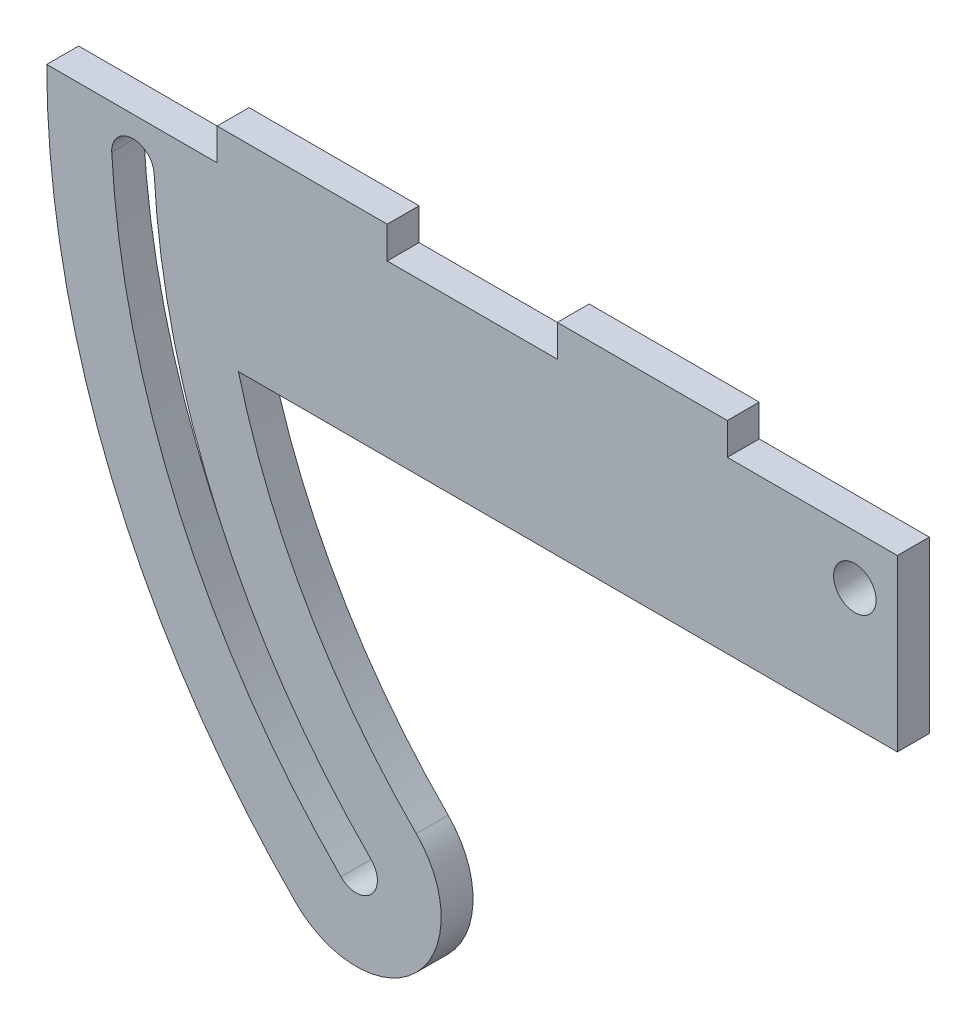
ISO-10303-21;
HEADER;
FILE_DESCRIPTION(('STEP AP214'),'2;1');
FILE_NAME('part.step','',(''),(''),'','','');
FILE_SCHEMA(('AUTOMOTIVE_DESIGN { 1 0 10303 214 1 1 1 1 }'));
ENDSEC;
DATA;
#1=APPLICATION_CONTEXT('core data for automotive mechanical design processes');
#2=APPLICATION_PROTOCOL_DEFINITION('international standard','automotive_design',2000,#1);
#3=PRODUCT_CONTEXT('',#1,'mechanical');
#4=PRODUCT('Part','Part','',(#3));
#5=PRODUCT_RELATED_PRODUCT_CATEGORY('part','',(#4));
#6=PRODUCT_DEFINITION_FORMATION('','',#4);
#7=PRODUCT_DEFINITION_CONTEXT('part definition',#1,'design');
#8=PRODUCT_DEFINITION('design','',#6,#7);
#9=PRODUCT_DEFINITION_SHAPE('','',#8);
#10=(LENGTH_UNIT() NAMED_UNIT(*) SI_UNIT(.MILLI.,.METRE.));
#11=(NAMED_UNIT(*) PLANE_ANGLE_UNIT() SI_UNIT($,.RADIAN.));
#12=(NAMED_UNIT(*) SI_UNIT($,.STERADIAN.) SOLID_ANGLE_UNIT());
#13=UNCERTAINTY_MEASURE_WITH_UNIT(LENGTH_MEASURE(1.E-05),#10,'distance_accuracy_value','');
#14=(GEOMETRIC_REPRESENTATION_CONTEXT(3) GLOBAL_UNCERTAINTY_ASSIGNED_CONTEXT((#13)) GLOBAL_UNIT_ASSIGNED_CONTEXT((#10,
#11,#12)) REPRESENTATION_CONTEXT('',''));
#15=CARTESIAN_POINT('',(0.,0.,0.));
#16=DIRECTION('',(0.,0.,1.));
#17=DIRECTION('',(1.,0.,0.));
#18=AXIS2_PLACEMENT_3D('',#15,#16,#17);
#19=CARTESIAN_POINT('',(127.,26.4331621621626,4.7625));
#20=DIRECTION('',(0.,0.,1.));
#21=DIRECTION('',(1.,0.,0.));
#22=AXIS2_PLACEMENT_3D('',#19,#20,#21);
#23=PLANE('',#22);
#24=CARTESIAN_POINT('',(127.,26.4331621621626,4.7625));
#25=DIRECTION('',(0.,0.,-1.));
#26=DIRECTION('',(1.,0.,0.));
#27=AXIS2_PLACEMENT_3D('',#24,#25,#26);
#28=CIRCLE('',#27,111.177818334353);
#29=CARTESIAN_POINT('',(48.3854107382526,-52.1814270995844,4.7625));
#30=VERTEX_POINT('',#29);
#31=CARTESIAN_POINT('',(15.9951351351355,20.2341891891896,4.7625));
#32=VERTEX_POINT('',#31);
#33=EDGE_CURVE('E166',#30,#32,#28,.T.);
#34=ORIENTED_EDGE('',*,*,#33,.F.);
#35=CARTESIAN_POINT('',(46.1607079705548,-54.4466693814164,4.7625));
#36=DIRECTION('',(0.,0.,1.));
#37=DIRECTION('',(-1.,0.,0.));
#38=AXIS2_PLACEMENT_3D('',#35,#36,#37);
#39=CIRCLE('',#38,3.17500000000025);
#40=CARTESIAN_POINT('',(43.8954656887227,-56.6713721491141,4.7625));
#41=VERTEX_POINT('',#40);
#42=EDGE_CURVE('E158',#41,#30,#39,.T.);
#43=ORIENTED_EDGE('',*,*,#42,.F.);
#44=CARTESIAN_POINT('',(127.,26.4331621621626,4.7625));
#45=DIRECTION('',(0.,0.,1.));
#46=DIRECTION('',(1.,0.,0.));
#47=AXIS2_PLACEMENT_3D('',#44,#45,#46);
#48=CIRCLE('',#47,117.527559517708);
#49=CARTESIAN_POINT('',(9.65200000000002,19.939,4.7625));
#50=VERTEX_POINT('',#49);
#51=EDGE_CURVE('E181',#50,#41,#48,.T.);
#52=ORIENTED_EDGE('',*,*,#51,.F.);
#53=CARTESIAN_POINT('',(12.8235675675678,20.0865945945948,4.7625));
#54=DIRECTION('',(0.,0.,1.));
#55=DIRECTION('',(1.,0.,0.));
#56=AXIS2_PLACEMENT_3D('',#53,#54,#55);
#57=CIRCLE('',#56,3.17500000000021);
#58=EDGE_CURVE('E179',#32,#50,#57,.T.);
#59=ORIENTED_EDGE('',*,*,#58,.F.);
#60=EDGE_LOOP('',(#34,#43,#52,#59));
#61=FACE_BOUND('',#60,.T.);
#62=CARTESIAN_POINT('',(127.,26.4331621621626,4.7625));
#63=DIRECTION('',(0.,0.,-1.));
#64=DIRECTION('',(1.,0.,0.));
#65=AXIS2_PLACEMENT_3D('',#62,#63,#64);
#66=CIRCLE('',#65,101.652692967862);
#67=CARTESIAN_POINT('',(55.140964091624,-45.4664132603473,4.7625));
#68=VERTEX_POINT('',#67);
#69=CARTESIAN_POINT('',(28.5752032595833,1.01998892019713,4.7625));
#70=VERTEX_POINT('',#69);
#71=EDGE_CURVE('E197',#68,#70,#66,.T.);
#72=ORIENTED_EDGE('',*,*,#71,.T.);
#73=DIRECTION('',(1.,0.,0.));
#74=VECTOR('',#73,1.);
#75=CARTESIAN_POINT('',(28.5752032595833,1.01998892019713,4.7625));
#76=LINE('',#75,#74);
#77=CARTESIAN_POINT('',(127.,1.01998892019713,4.7625));
#78=VERTEX_POINT('',#77);
#79=EDGE_CURVE('E200',#70,#78,#76,.T.);
#80=ORIENTED_EDGE('',*,*,#79,.T.);
#81=DIRECTION('',(0.,1.,0.));
#82=VECTOR('',#81,1.);
#83=CARTESIAN_POINT('',(127.,1.01998892019713,4.7625));
#84=LINE('',#83,#82);
#85=CARTESIAN_POINT('',(127.,26.4331621621626,4.7625));
#86=VERTEX_POINT('',#85);
#87=EDGE_CURVE('E203',#78,#86,#84,.T.);
#88=ORIENTED_EDGE('',*,*,#87,.T.);
#89=DIRECTION('',(-1.,0.,0.));
#90=VECTOR('',#89,1.);
#91=CARTESIAN_POINT('',(101.6,26.4331621621626,4.7625));
#92=LINE('',#91,#90);
#93=CARTESIAN_POINT('',(101.6,26.4331621621626,4.7625));
#94=VERTEX_POINT('',#93);
#95=EDGE_CURVE('E205',#86,#94,#92,.T.);
#96=ORIENTED_EDGE('',*,*,#95,.T.);
#97=DIRECTION('',(0.,1.,0.));
#98=VECTOR('',#97,1.);
#99=CARTESIAN_POINT('',(101.6,26.4331621621626,4.7625));
#100=LINE('',#99,#98);
#101=CARTESIAN_POINT('',(101.6,31.1956621621626,4.7625));
#102=VERTEX_POINT('',#101);
#103=EDGE_CURVE('E207',#94,#102,#100,.T.);
#104=ORIENTED_EDGE('',*,*,#103,.T.);
#105=DIRECTION('',(-1.,0.,0.));
#106=VECTOR('',#105,1.);
#107=CARTESIAN_POINT('',(101.6,31.1956621621626,4.7625));
#108=LINE('',#107,#106);
#109=CARTESIAN_POINT('',(76.2000000000004,31.1956621621626,4.7625));
#110=VERTEX_POINT('',#109);
#111=EDGE_CURVE('E209',#102,#110,#108,.T.);
#112=ORIENTED_EDGE('',*,*,#111,.T.);
#113=DIRECTION('',(0.,-1.,0.));
#114=VECTOR('',#113,1.);
#115=CARTESIAN_POINT('',(76.2000000000004,26.4331621621626,4.7625));
#116=LINE('',#115,#114);
#117=CARTESIAN_POINT('',(76.2000000000004,26.4331621621626,4.7625));
#118=VERTEX_POINT('',#117);
#119=EDGE_CURVE('E211',#110,#118,#116,.T.);
#120=ORIENTED_EDGE('',*,*,#119,.T.);
#121=DIRECTION('',(-1.,0.,0.));
#122=VECTOR('',#121,1.);
#123=CARTESIAN_POINT('',(50.7999999999996,26.4331621621626,4.7625));
#124=LINE('',#123,#122);
#125=CARTESIAN_POINT('',(50.7999999999996,26.4331621621626,4.7625));
#126=VERTEX_POINT('',#125);
#127=EDGE_CURVE('E213',#118,#126,#124,.T.);
#128=ORIENTED_EDGE('',*,*,#127,.T.);
#129=DIRECTION('',(0.,1.,0.));
#130=VECTOR('',#129,1.);
#131=CARTESIAN_POINT('',(50.7999999999996,26.4331621621626,4.7625));
#132=LINE('',#131,#130);
#133=CARTESIAN_POINT('',(50.7999999999996,31.1956621621626,4.7625));
#134=VERTEX_POINT('',#133);
#135=EDGE_CURVE('E215',#126,#134,#132,.T.);
#136=ORIENTED_EDGE('',*,*,#135,.T.);
#137=DIRECTION('',(-1.,0.,0.));
#138=VECTOR('',#137,1.);
#139=CARTESIAN_POINT('',(25.3999999999996,31.1956621621626,4.7625));
#140=LINE('',#139,#138);
#141=CARTESIAN_POINT('',(25.3999999999996,31.1956621621626,4.7625));
#142=VERTEX_POINT('',#141);
#143=EDGE_CURVE('E217',#134,#142,#140,.T.);
#144=ORIENTED_EDGE('',*,*,#143,.T.);
#145=DIRECTION('',(0.,-1.,0.));
#146=VECTOR('',#145,1.);
#147=CARTESIAN_POINT('',(25.3999999999996,26.4331621621626,4.7625));
#148=LINE('',#147,#146);
#149=CARTESIAN_POINT('',(25.3999999999996,26.4331621621626,4.7625));
#150=VERTEX_POINT('',#149);
#151=EDGE_CURVE('E219',#142,#150,#148,.T.);
#152=ORIENTED_EDGE('',*,*,#151,.T.);
#153=DIRECTION('',(-1.,0.,0.));
#154=VECTOR('',#153,1.);
#155=CARTESIAN_POINT('',(-0.0526921598312802,26.4331621621626,4.7625));
#156=LINE('',#155,#154);
#157=CARTESIAN_POINT('',(-0.0526921598312802,26.4331621621626,4.7625));
#158=VERTEX_POINT('',#157);
#159=EDGE_CURVE('E221',#150,#158,#156,.T.);
#160=ORIENTED_EDGE('',*,*,#159,.T.);
#161=CARTESIAN_POINT('',(127.,26.4331621621626,4.7625));
#162=DIRECTION('',(0.,0.,1.));
#163=DIRECTION('',(1.,0.,0.));
#164=AXIS2_PLACEMENT_3D('',#161,#162,#163);
#165=CIRCLE('',#164,127.052692159831);
#166=CARTESIAN_POINT('',(37.1804518494856,-63.4269255024856,4.7625));
#167=VERTEX_POINT('',#166);
#168=EDGE_CURVE('E223',#158,#167,#165,.T.);
#169=ORIENTED_EDGE('',*,*,#168,.T.);
#170=CARTESIAN_POINT('',(46.1607079705548,-54.4466693814164,4.7625));
#171=DIRECTION('',(0.,0.,1.));
#172=DIRECTION('',(-1.,0.,0.));
#173=AXIS2_PLACEMENT_3D('',#170,#171,#172);
#174=CIRCLE('',#173,12.7);
#175=EDGE_CURVE('E225',#167,#68,#174,.T.);
#176=ORIENTED_EDGE('',*,*,#175,.T.);
#177=EDGE_LOOP('',(#72,#80,#88,#96,#104,#112,#120,#128,#136,#144,#152,#160,#169,#176));
#178=FACE_BOUND('',#177,.T.);
#179=CARTESIAN_POINT('',(120.65,19.05,4.7625));
#180=DIRECTION('',(0.,0.,1.));
#181=DIRECTION('',(1.,0.,0.));
#182=AXIS2_PLACEMENT_3D('',#179,#180,#181);
#183=CIRCLE('',#182,3.175);
#184=CARTESIAN_POINT('',(123.825,19.05,4.7625));
#185=VERTEX_POINT('',#184);
#186=EDGE_CURVE('E187',#185,#185,#183,.T.);
#187=ORIENTED_EDGE('',*,*,#186,.F.);
#188=EDGE_LOOP('',(#187));
#189=FACE_BOUND('',#188,.T.);
#190=ADVANCED_FACE('F33',(#61,#178,#189),#23,.T.);
#191=CARTESIAN_POINT('',(127.,26.4331621621626,0.));
#192=DIRECTION('',(0.,0.,1.));
#193=DIRECTION('',(1.,0.,0.));
#194=AXIS2_PLACEMENT_3D('',#191,#192,#193);
#195=PLANE('',#194);
#196=CARTESIAN_POINT('',(46.1607079705548,-54.4466693814164,0.));
#197=DIRECTION('',(0.,0.,1.));
#198=DIRECTION('',(-1.,0.,0.));
#199=AXIS2_PLACEMENT_3D('',#196,#197,#198);
#200=CIRCLE('',#199,3.17500000000025);
#201=CARTESIAN_POINT('',(43.8954656887227,-56.6713721491141,0.));
#202=VERTEX_POINT('',#201);
#203=CARTESIAN_POINT('',(48.3854107382526,-52.1814270995844,0.));
#204=VERTEX_POINT('',#203);
#205=EDGE_CURVE('E56',#202,#204,#200,.T.);
#206=ORIENTED_EDGE('',*,*,#205,.T.);
#207=CARTESIAN_POINT('',(127.,26.4331621621626,0.));
#208=DIRECTION('',(0.,0.,-1.));
#209=DIRECTION('',(1.,0.,0.));
#210=AXIS2_PLACEMENT_3D('',#207,#208,#209);
#211=CIRCLE('',#210,111.177818334353);
#212=CARTESIAN_POINT('',(15.9951351351355,20.2341891891896,0.));
#213=VERTEX_POINT('',#212);
#214=EDGE_CURVE('E173',#204,#213,#211,.T.);
#215=ORIENTED_EDGE('',*,*,#214,.T.);
#216=CARTESIAN_POINT('',(12.8235675675678,20.0865945945948,0.));
#217=DIRECTION('',(0.,0.,1.));
#218=DIRECTION('',(1.,0.,0.));
#219=AXIS2_PLACEMENT_3D('',#216,#217,#218);
#220=CIRCLE('',#219,3.17500000000021);
#221=CARTESIAN_POINT('',(9.652,19.939,0.));
#222=VERTEX_POINT('',#221);
#223=EDGE_CURVE('E189',#213,#222,#220,.T.);
#224=ORIENTED_EDGE('',*,*,#223,.T.);
#225=CARTESIAN_POINT('',(127.,26.4331621621626,0.));
#226=DIRECTION('',(0.,0.,1.));
#227=DIRECTION('',(1.,0.,0.));
#228=AXIS2_PLACEMENT_3D('',#225,#226,#227);
#229=CIRCLE('',#228,117.527559517708);
#230=EDGE_CURVE('E167',#222,#202,#229,.T.);
#231=ORIENTED_EDGE('',*,*,#230,.T.);
#232=EDGE_LOOP('',(#206,#215,#224,#231));
#233=FACE_BOUND('',#232,.T.);
#234=CARTESIAN_POINT('',(127.,26.4331621621626,0.));
#235=DIRECTION('',(0.,0.,-1.));
#236=DIRECTION('',(1.,0.,0.));
#237=AXIS2_PLACEMENT_3D('',#234,#235,#236);
#238=CIRCLE('',#237,101.652692967862);
#239=CARTESIAN_POINT('',(55.140964091624,-45.4664132603473,0.));
#240=VERTEX_POINT('',#239);
#241=CARTESIAN_POINT('',(28.5752032595833,1.01998892019713,0.));
#242=VERTEX_POINT('',#241);
#243=EDGE_CURVE('E174',#240,#242,#238,.T.);
#244=ORIENTED_EDGE('',*,*,#243,.F.);
#245=CARTESIAN_POINT('',(46.1607079705548,-54.4466693814164,0.));
#246=DIRECTION('',(0.,0.,1.));
#247=DIRECTION('',(-1.,0.,0.));
#248=AXIS2_PLACEMENT_3D('',#245,#246,#247);
#249=CIRCLE('',#248,12.7);
#250=CARTESIAN_POINT('',(37.1804518494856,-63.4269255024856,0.));
#251=VERTEX_POINT('',#250);
#252=EDGE_CURVE('E201',#251,#240,#249,.T.);
#253=ORIENTED_EDGE('',*,*,#252,.F.);
#254=CARTESIAN_POINT('',(127.,26.4331621621626,0.));
#255=DIRECTION('',(0.,0.,1.));
#256=DIRECTION('',(1.,0.,0.));
#257=AXIS2_PLACEMENT_3D('',#254,#255,#256);
#258=CIRCLE('',#257,127.052692159831);
#259=CARTESIAN_POINT('',(-0.0526921598312802,26.4331621621626,0.));
#260=VERTEX_POINT('',#259);
#261=EDGE_CURVE('E252',#260,#251,#258,.T.);
#262=ORIENTED_EDGE('',*,*,#261,.F.);
#263=DIRECTION('',(-1.,0.,0.));
#264=VECTOR('',#263,1.);
#265=CARTESIAN_POINT('',(-0.0526921598312802,26.4331621621626,0.));
#266=LINE('',#265,#264);
#267=CARTESIAN_POINT('',(25.3999999999996,26.4331621621626,0.));
#268=VERTEX_POINT('',#267);
#269=EDGE_CURVE('E250',#268,#260,#266,.T.);
#270=ORIENTED_EDGE('',*,*,#269,.F.);
#271=DIRECTION('',(0.,-1.,0.));
#272=VECTOR('',#271,1.);
#273=CARTESIAN_POINT('',(25.3999999999996,26.4331621621626,0.));
#274=LINE('',#273,#272);
#275=CARTESIAN_POINT('',(25.3999999999996,31.1956621621626,0.));
#276=VERTEX_POINT('',#275);
#277=EDGE_CURVE('E248',#276,#268,#274,.T.);
#278=ORIENTED_EDGE('',*,*,#277,.F.);
#279=DIRECTION('',(-1.,0.,0.));
#280=VECTOR('',#279,1.);
#281=CARTESIAN_POINT('',(25.3999999999996,31.1956621621626,0.));
#282=LINE('',#281,#280);
#283=CARTESIAN_POINT('',(50.7999999999996,31.1956621621626,0.));
#284=VERTEX_POINT('',#283);
#285=EDGE_CURVE('E246',#284,#276,#282,.T.);
#286=ORIENTED_EDGE('',*,*,#285,.F.);
#287=DIRECTION('',(0.,1.,0.));
#288=VECTOR('',#287,1.);
#289=CARTESIAN_POINT('',(50.7999999999996,26.4331621621626,0.));
#290=LINE('',#289,#288);
#291=CARTESIAN_POINT('',(50.7999999999996,26.4331621621626,0.));
#292=VERTEX_POINT('',#291);
#293=EDGE_CURVE('E244',#292,#284,#290,.T.);
#294=ORIENTED_EDGE('',*,*,#293,.F.);
#295=DIRECTION('',(-1.,0.,0.));
#296=VECTOR('',#295,1.);
#297=CARTESIAN_POINT('',(50.7999999999996,26.4331621621626,0.));
#298=LINE('',#297,#296);
#299=CARTESIAN_POINT('',(76.2000000000004,26.4331621621626,0.));
#300=VERTEX_POINT('',#299);
#301=EDGE_CURVE('E242',#300,#292,#298,.T.);
#302=ORIENTED_EDGE('',*,*,#301,.F.);
#303=DIRECTION('',(0.,-1.,0.));
#304=VECTOR('',#303,1.);
#305=CARTESIAN_POINT('',(76.2000000000004,26.4331621621626,0.));
#306=LINE('',#305,#304);
#307=CARTESIAN_POINT('',(76.2000000000004,31.1956621621626,0.));
#308=VERTEX_POINT('',#307);
#309=EDGE_CURVE('E240',#308,#300,#306,.T.);
#310=ORIENTED_EDGE('',*,*,#309,.F.);
#311=DIRECTION('',(-1.,0.,0.));
#312=VECTOR('',#311,1.);
#313=CARTESIAN_POINT('',(101.6,31.1956621621626,0.));
#314=LINE('',#313,#312);
#315=CARTESIAN_POINT('',(101.6,31.1956621621626,0.));
#316=VERTEX_POINT('',#315);
#317=EDGE_CURVE('E238',#316,#308,#314,.T.);
#318=ORIENTED_EDGE('',*,*,#317,.F.);
#319=DIRECTION('',(0.,1.,0.));
#320=VECTOR('',#319,1.);
#321=CARTESIAN_POINT('',(101.6,26.4331621621626,0.));
#322=LINE('',#321,#320);
#323=CARTESIAN_POINT('',(101.6,26.4331621621626,0.));
#324=VERTEX_POINT('',#323);
#325=EDGE_CURVE('E236',#324,#316,#322,.T.);
#326=ORIENTED_EDGE('',*,*,#325,.F.);
#327=DIRECTION('',(-1.,0.,0.));
#328=VECTOR('',#327,1.);
#329=CARTESIAN_POINT('',(101.6,26.4331621621626,0.));
#330=LINE('',#329,#328);
#331=CARTESIAN_POINT('',(127.,26.4331621621626,0.));
#332=VERTEX_POINT('',#331);
#333=EDGE_CURVE('E234',#332,#324,#330,.T.);
#334=ORIENTED_EDGE('',*,*,#333,.F.);
#335=DIRECTION('',(0.,1.,0.));
#336=VECTOR('',#335,1.);
#337=CARTESIAN_POINT('',(127.,1.01998892019713,0.));
#338=LINE('',#337,#336);
#339=CARTESIAN_POINT('',(127.,1.01998892019713,0.));
#340=VERTEX_POINT('',#339);
#341=EDGE_CURVE('E232',#340,#332,#338,.T.);
#342=ORIENTED_EDGE('',*,*,#341,.F.);
#343=DIRECTION('',(1.,0.,0.));
#344=VECTOR('',#343,1.);
#345=CARTESIAN_POINT('',(28.5752032595833,1.01998892019713,0.));
#346=LINE('',#345,#344);
#347=EDGE_CURVE('E230',#242,#340,#346,.T.);
#348=ORIENTED_EDGE('',*,*,#347,.F.);
#349=EDGE_LOOP('',(#244,#253,#262,#270,#278,#286,#294,#302,#310,#318,#326,#334,#342,#348));
#350=FACE_BOUND('',#349,.T.);
#351=CARTESIAN_POINT('',(120.65,19.05,0.));
#352=DIRECTION('',(0.,0.,1.));
#353=DIRECTION('',(1.,0.,0.));
#354=AXIS2_PLACEMENT_3D('',#351,#352,#353);
#355=CIRCLE('',#354,3.175);
#356=CARTESIAN_POINT('',(123.825,19.05,0.));
#357=VERTEX_POINT('',#356);
#358=EDGE_CURVE('E538',#357,#357,#355,.T.);
#359=ORIENTED_EDGE('',*,*,#358,.T.);
#360=EDGE_LOOP('',(#359));
#361=FACE_BOUND('',#360,.T.);
#362=ADVANCED_FACE('F300',(#233,#350,#361),#195,.F.);
#363=CARTESIAN_POINT('',(127.,26.4331621621626,4.7625));
#364=DIRECTION('',(0.,0.,-1.));
#365=DIRECTION('',(-1.,0.,0.));
#366=AXIS2_PLACEMENT_3D('',#363,#364,#365);
#367=CYLINDRICAL_SURFACE('',#366,101.652692967862);
#368=ORIENTED_EDGE('',*,*,#243,.T.);
#369=DIRECTION('',(0.,0.,-1.));
#370=VECTOR('',#369,1.);
#371=CARTESIAN_POINT('',(28.5752032595833,1.01998892019713,4.7625));
#372=LINE('',#371,#370);
#373=EDGE_CURVE('E11',#70,#242,#372,.T.);
#374=ORIENTED_EDGE('',*,*,#373,.F.);
#375=ORIENTED_EDGE('',*,*,#71,.F.);
#376=DIRECTION('',(0.,0.,-1.));
#377=VECTOR('',#376,1.);
#378=CARTESIAN_POINT('',(55.140964091624,-45.4664132603473,4.7625));
#379=LINE('',#378,#377);
#380=EDGE_CURVE('E227',#68,#240,#379,.T.);
#381=ORIENTED_EDGE('',*,*,#380,.T.);
#382=EDGE_LOOP('',(#368,#374,#375,#381));
#383=FACE_BOUND('',#382,.T.);
#384=ADVANCED_FACE('F35',(#383),#367,.F.);
#385=CARTESIAN_POINT('',(28.5752032595833,1.01998892019713,4.7625));
#386=DIRECTION('',(0.,1.,0.));
#387=DIRECTION('',(0.,0.,1.));
#388=AXIS2_PLACEMENT_3D('',#385,#386,#387);
#389=PLANE('',#388);
#390=ORIENTED_EDGE('',*,*,#347,.T.);
#391=DIRECTION('',(0.,0.,-1.));
#392=VECTOR('',#391,1.);
#393=CARTESIAN_POINT('',(127.,1.01998892019713,4.7625));
#394=LINE('',#393,#392);
#395=EDGE_CURVE('E41',#78,#340,#394,.T.);
#396=ORIENTED_EDGE('',*,*,#395,.F.);
#397=ORIENTED_EDGE('',*,*,#79,.F.);
#398=ORIENTED_EDGE('',*,*,#373,.T.);
#399=EDGE_LOOP('',(#390,#396,#397,#398));
#400=FACE_BOUND('',#399,.T.);
#401=ADVANCED_FACE('F317',(#400),#389,.F.);
#402=CARTESIAN_POINT('',(127.,1.01998892019713,4.7625));
#403=DIRECTION('',(-1.,0.,0.));
#404=DIRECTION('',(0.,0.,1.));
#405=AXIS2_PLACEMENT_3D('',#402,#403,#404);
#406=PLANE('',#405);
#407=ORIENTED_EDGE('',*,*,#341,.T.);
#408=DIRECTION('',(0.,0.,-1.));
#409=VECTOR('',#408,1.);
#410=CARTESIAN_POINT('',(127.,26.4331621621626,4.7625));
#411=LINE('',#410,#409);
#412=EDGE_CURVE('E287',#86,#332,#411,.T.);
#413=ORIENTED_EDGE('',*,*,#412,.F.);
#414=ORIENTED_EDGE('',*,*,#87,.F.);
#415=ORIENTED_EDGE('',*,*,#395,.T.);
#416=EDGE_LOOP('',(#407,#413,#414,#415));
#417=FACE_BOUND('',#416,.T.);
#418=ADVANCED_FACE('F294',(#417),#406,.F.);
#419=CARTESIAN_POINT('',(101.6,26.4331621621626,4.7625));
#420=DIRECTION('',(0.,-1.,0.));
#421=DIRECTION('',(0.,0.,-1.));
#422=AXIS2_PLACEMENT_3D('',#419,#420,#421);
#423=PLANE('',#422);
#424=ORIENTED_EDGE('',*,*,#333,.T.);
#425=DIRECTION('',(0.,0.,-1.));
#426=VECTOR('',#425,1.);
#427=CARTESIAN_POINT('',(101.6,26.4331621621626,4.7625));
#428=LINE('',#427,#426);
#429=EDGE_CURVE('E284',#94,#324,#428,.T.);
#430=ORIENTED_EDGE('',*,*,#429,.F.);
#431=ORIENTED_EDGE('',*,*,#95,.F.);
#432=ORIENTED_EDGE('',*,*,#412,.T.);
#433=EDGE_LOOP('',(#424,#430,#431,#432));
#434=FACE_BOUND('',#433,.T.);
#435=ADVANCED_FACE('F306',(#434),#423,.F.);
#436=CARTESIAN_POINT('',(101.6,26.4331621621626,4.7625));
#437=DIRECTION('',(-1.,0.,0.));
#438=DIRECTION('',(0.,0.,1.));
#439=AXIS2_PLACEMENT_3D('',#436,#437,#438);
#440=PLANE('',#439);
#441=ORIENTED_EDGE('',*,*,#325,.T.);
#442=DIRECTION('',(0.,0.,-1.));
#443=VECTOR('',#442,1.);
#444=CARTESIAN_POINT('',(101.6,31.1956621621626,4.7625));
#445=LINE('',#444,#443);
#446=EDGE_CURVE('E281',#102,#316,#445,.T.);
#447=ORIENTED_EDGE('',*,*,#446,.F.);
#448=ORIENTED_EDGE('',*,*,#103,.F.);
#449=ORIENTED_EDGE('',*,*,#429,.T.);
#450=EDGE_LOOP('',(#441,#447,#448,#449));
#451=FACE_BOUND('',#450,.T.);
#452=ADVANCED_FACE('F310',(#451),#440,.F.);
#453=CARTESIAN_POINT('',(101.6,31.1956621621626,4.7625));
#454=DIRECTION('',(0.,-1.,0.));
#455=DIRECTION('',(0.,0.,-1.));
#456=AXIS2_PLACEMENT_3D('',#453,#454,#455);
#457=PLANE('',#456);
#458=ORIENTED_EDGE('',*,*,#317,.T.);
#459=DIRECTION('',(0.,0.,-1.));
#460=VECTOR('',#459,1.);
#461=CARTESIAN_POINT('',(76.2000000000004,31.1956621621626,4.7625));
#462=LINE('',#461,#460);
#463=EDGE_CURVE('E278',#110,#308,#462,.T.);
#464=ORIENTED_EDGE('',*,*,#463,.F.);
#465=ORIENTED_EDGE('',*,*,#111,.F.);
#466=ORIENTED_EDGE('',*,*,#446,.T.);
#467=EDGE_LOOP('',(#458,#464,#465,#466));
#468=FACE_BOUND('',#467,.T.);
#469=ADVANCED_FACE('F360',(#468),#457,.F.);
#470=CARTESIAN_POINT('',(76.2000000000004,26.4331621621626,4.7625));
#471=DIRECTION('',(1.,0.,0.));
#472=DIRECTION('',(0.,0.,-1.));
#473=AXIS2_PLACEMENT_3D('',#470,#471,#472);
#474=PLANE('',#473);
#475=ORIENTED_EDGE('',*,*,#309,.T.);
#476=DIRECTION('',(0.,0.,-1.));
#477=VECTOR('',#476,1.);
#478=CARTESIAN_POINT('',(76.2000000000004,26.4331621621626,4.7625));
#479=LINE('',#478,#477);
#480=EDGE_CURVE('E275',#118,#300,#479,.T.);
#481=ORIENTED_EDGE('',*,*,#480,.F.);
#482=ORIENTED_EDGE('',*,*,#119,.F.);
#483=ORIENTED_EDGE('',*,*,#463,.T.);
#484=EDGE_LOOP('',(#475,#481,#482,#483));
#485=FACE_BOUND('',#484,.T.);
#486=ADVANCED_FACE('F358',(#485),#474,.F.);
#487=CARTESIAN_POINT('',(50.7999999999996,26.4331621621626,4.7625));
#488=DIRECTION('',(0.,-1.,0.));
#489=DIRECTION('',(0.,0.,-1.));
#490=AXIS2_PLACEMENT_3D('',#487,#488,#489);
#491=PLANE('',#490);
#492=ORIENTED_EDGE('',*,*,#301,.T.);
#493=DIRECTION('',(0.,0.,-1.));
#494=VECTOR('',#493,1.);
#495=CARTESIAN_POINT('',(50.7999999999996,26.4331621621626,4.7625));
#496=LINE('',#495,#494);
#497=EDGE_CURVE('E272',#126,#292,#496,.T.);
#498=ORIENTED_EDGE('',*,*,#497,.F.);
#499=ORIENTED_EDGE('',*,*,#127,.F.);
#500=ORIENTED_EDGE('',*,*,#480,.T.);
#501=EDGE_LOOP('',(#492,#498,#499,#500));
#502=FACE_BOUND('',#501,.T.);
#503=ADVANCED_FACE('F353',(#502),#491,.F.);
#504=CARTESIAN_POINT('',(50.7999999999996,26.4331621621626,4.7625));
#505=DIRECTION('',(-1.,0.,0.));
#506=DIRECTION('',(0.,0.,1.));
#507=AXIS2_PLACEMENT_3D('',#504,#505,#506);
#508=PLANE('',#507);
#509=ORIENTED_EDGE('',*,*,#293,.T.);
#510=DIRECTION('',(0.,0.,-1.));
#511=VECTOR('',#510,1.);
#512=CARTESIAN_POINT('',(50.7999999999996,31.1956621621626,4.7625));
#513=LINE('',#512,#511);
#514=EDGE_CURVE('E269',#134,#284,#513,.T.);
#515=ORIENTED_EDGE('',*,*,#514,.F.);
#516=ORIENTED_EDGE('',*,*,#135,.F.);
#517=ORIENTED_EDGE('',*,*,#497,.T.);
#518=EDGE_LOOP('',(#509,#515,#516,#517));
#519=FACE_BOUND('',#518,.T.);
#520=ADVANCED_FACE('F348',(#519),#508,.F.);
#521=CARTESIAN_POINT('',(25.3999999999996,31.1956621621626,4.7625));
#522=DIRECTION('',(0.,-1.,0.));
#523=DIRECTION('',(0.,0.,-1.));
#524=AXIS2_PLACEMENT_3D('',#521,#522,#523);
#525=PLANE('',#524);
#526=ORIENTED_EDGE('',*,*,#285,.T.);
#527=DIRECTION('',(0.,0.,-1.));
#528=VECTOR('',#527,1.);
#529=CARTESIAN_POINT('',(25.3999999999996,31.1956621621626,4.7625));
#530=LINE('',#529,#528);
#531=EDGE_CURVE('E266',#142,#276,#530,.T.);
#532=ORIENTED_EDGE('',*,*,#531,.F.);
#533=ORIENTED_EDGE('',*,*,#143,.F.);
#534=ORIENTED_EDGE('',*,*,#514,.T.);
#535=EDGE_LOOP('',(#526,#532,#533,#534));
#536=FACE_BOUND('',#535,.T.);
#537=ADVANCED_FACE('F344',(#536),#525,.F.);
#538=CARTESIAN_POINT('',(25.3999999999996,26.4331621621626,4.7625));
#539=DIRECTION('',(1.,0.,0.));
#540=DIRECTION('',(0.,0.,-1.));
#541=AXIS2_PLACEMENT_3D('',#538,#539,#540);
#542=PLANE('',#541);
#543=ORIENTED_EDGE('',*,*,#277,.T.);
#544=DIRECTION('',(0.,0.,-1.));
#545=VECTOR('',#544,1.);
#546=CARTESIAN_POINT('',(25.3999999999996,26.4331621621626,4.7625));
#547=LINE('',#546,#545);
#548=EDGE_CURVE('E263',#150,#268,#547,.T.);
#549=ORIENTED_EDGE('',*,*,#548,.F.);
#550=ORIENTED_EDGE('',*,*,#151,.F.);
#551=ORIENTED_EDGE('',*,*,#531,.T.);
#552=EDGE_LOOP('',(#543,#549,#550,#551));
#553=FACE_BOUND('',#552,.T.);
#554=ADVANCED_FACE('F339',(#553),#542,.F.);
#555=CARTESIAN_POINT('',(-0.0526921598312802,26.4331621621626,4.7625));
#556=DIRECTION('',(0.,-1.,0.));
#557=DIRECTION('',(0.,0.,-1.));
#558=AXIS2_PLACEMENT_3D('',#555,#556,#557);
#559=PLANE('',#558);
#560=ORIENTED_EDGE('',*,*,#269,.T.);
#561=DIRECTION('',(0.,0.,-1.));
#562=VECTOR('',#561,1.);
#563=CARTESIAN_POINT('',(-0.0526921598312802,26.4331621621626,4.7625));
#564=LINE('',#563,#562);
#565=EDGE_CURVE('E260',#158,#260,#564,.T.);
#566=ORIENTED_EDGE('',*,*,#565,.F.);
#567=ORIENTED_EDGE('',*,*,#159,.F.);
#568=ORIENTED_EDGE('',*,*,#548,.T.);
#569=EDGE_LOOP('',(#560,#566,#567,#568));
#570=FACE_BOUND('',#569,.T.);
#571=ADVANCED_FACE('F333',(#570),#559,.F.);
#572=CARTESIAN_POINT('',(127.,26.4331621621626,4.7625));
#573=DIRECTION('',(0.,0.,-1.));
#574=DIRECTION('',(-1.,0.,0.));
#575=AXIS2_PLACEMENT_3D('',#572,#573,#574);
#576=CYLINDRICAL_SURFACE('',#575,127.052692159831);
#577=ORIENTED_EDGE('',*,*,#261,.T.);
#578=DIRECTION('',(0.,0.,-1.));
#579=VECTOR('',#578,1.);
#580=CARTESIAN_POINT('',(37.1804518494856,-63.4269255024856,4.7625));
#581=LINE('',#580,#579);
#582=EDGE_CURVE('E257',#167,#251,#581,.T.);
#583=ORIENTED_EDGE('',*,*,#582,.F.);
#584=ORIENTED_EDGE('',*,*,#168,.F.);
#585=ORIENTED_EDGE('',*,*,#565,.T.);
#586=EDGE_LOOP('',(#577,#583,#584,#585));
#587=FACE_BOUND('',#586,.T.);
#588=ADVANCED_FACE('F329',(#587),#576,.T.);
#589=CARTESIAN_POINT('',(46.1607079705548,-54.4466693814164,4.7625));
#590=DIRECTION('',(0.,0.,-1.));
#591=DIRECTION('',(-1.,0.,0.));
#592=AXIS2_PLACEMENT_3D('',#589,#590,#591);
#593=CYLINDRICAL_SURFACE('',#592,12.7);
#594=ORIENTED_EDGE('',*,*,#252,.T.);
#595=ORIENTED_EDGE('',*,*,#380,.F.);
#596=ORIENTED_EDGE('',*,*,#175,.F.);
#597=ORIENTED_EDGE('',*,*,#582,.T.);
#598=EDGE_LOOP('',(#594,#595,#596,#597));
#599=FACE_BOUND('',#598,.T.);
#600=ADVANCED_FACE('F324',(#599),#593,.T.);
#601=CARTESIAN_POINT('',(46.1607079705548,-54.4466693814164,4.7625));
#602=DIRECTION('',(0.,0.,-1.));
#603=DIRECTION('',(-1.,0.,0.));
#604=AXIS2_PLACEMENT_3D('',#601,#602,#603);
#605=CYLINDRICAL_SURFACE('',#604,3.17500000000025);
#606=ORIENTED_EDGE('',*,*,#205,.F.);
#607=DIRECTION('',(0.,0.,-1.));
#608=VECTOR('',#607,1.);
#609=CARTESIAN_POINT('',(43.8954656887227,-56.6713721491141,4.7625));
#610=LINE('',#609,#608);
#611=EDGE_CURVE('E162',#41,#202,#610,.T.);
#612=ORIENTED_EDGE('',*,*,#611,.F.);
#613=ORIENTED_EDGE('',*,*,#42,.T.);
#614=DIRECTION('',(0.,0.,-1.));
#615=VECTOR('',#614,1.);
#616=CARTESIAN_POINT('',(48.3854107382526,-52.1814270995844,4.7625));
#617=LINE('',#616,#615);
#618=EDGE_CURVE('E161',#30,#204,#617,.T.);
#619=ORIENTED_EDGE('',*,*,#618,.T.);
#620=EDGE_LOOP('',(#606,#612,#613,#619));
#621=FACE_BOUND('',#620,.T.);
#622=ADVANCED_FACE('F160',(#621),#605,.F.);
#623=CARTESIAN_POINT('',(127.,26.4331621621626,4.7625));
#624=DIRECTION('',(0.,0.,-1.));
#625=DIRECTION('',(-1.,0.,0.));
#626=AXIS2_PLACEMENT_3D('',#623,#624,#625);
#627=CYLINDRICAL_SURFACE('',#626,111.177818334353);
#628=ORIENTED_EDGE('',*,*,#214,.F.);
#629=ORIENTED_EDGE('',*,*,#618,.F.);
#630=ORIENTED_EDGE('',*,*,#33,.T.);
#631=DIRECTION('',(0.,0.,-1.));
#632=VECTOR('',#631,1.);
#633=CARTESIAN_POINT('',(15.9951351351355,20.2341891891896,4.7625));
#634=LINE('',#633,#632);
#635=EDGE_CURVE('E175',#32,#213,#634,.T.);
#636=ORIENTED_EDGE('',*,*,#635,.T.);
#637=EDGE_LOOP('',(#628,#629,#630,#636));
#638=FACE_BOUND('',#637,.T.);
#639=ADVANCED_FACE('F170',(#638),#627,.T.);
#640=CARTESIAN_POINT('',(12.8235675675678,20.0865945945948,4.7625));
#641=DIRECTION('',(0.,0.,-1.));
#642=DIRECTION('',(-1.,0.,0.));
#643=AXIS2_PLACEMENT_3D('',#640,#641,#642);
#644=CYLINDRICAL_SURFACE('',#643,3.17500000000021);
#645=ORIENTED_EDGE('',*,*,#223,.F.);
#646=ORIENTED_EDGE('',*,*,#635,.F.);
#647=ORIENTED_EDGE('',*,*,#58,.T.);
#648=DIRECTION('',(0.,0.,-1.));
#649=VECTOR('',#648,1.);
#650=CARTESIAN_POINT('',(9.652,19.939,4.7625));
#651=LINE('',#650,#649);
#652=EDGE_CURVE('E48',#50,#222,#651,.T.);
#653=ORIENTED_EDGE('',*,*,#652,.T.);
#654=EDGE_LOOP('',(#645,#646,#647,#653));
#655=FACE_BOUND('',#654,.T.);
#656=ADVANCED_FACE('F431',(#655),#644,.F.);
#657=CARTESIAN_POINT('',(127.,26.4331621621626,4.7625));
#658=DIRECTION('',(0.,0.,-1.));
#659=DIRECTION('',(-1.,0.,0.));
#660=AXIS2_PLACEMENT_3D('',#657,#658,#659);
#661=CYLINDRICAL_SURFACE('',#660,117.527559517708);
#662=ORIENTED_EDGE('',*,*,#230,.F.);
#663=ORIENTED_EDGE('',*,*,#652,.F.);
#664=ORIENTED_EDGE('',*,*,#51,.T.);
#665=ORIENTED_EDGE('',*,*,#611,.T.);
#666=EDGE_LOOP('',(#662,#663,#664,#665));
#667=FACE_BOUND('',#666,.T.);
#668=ADVANCED_FACE('F437',(#667),#661,.F.);
#669=CARTESIAN_POINT('',(120.65,19.05,4.7625));
#670=DIRECTION('',(0.,0.,-1.));
#671=DIRECTION('',(-1.,0.,0.));
#672=AXIS2_PLACEMENT_3D('',#669,#670,#671);
#673=CYLINDRICAL_SURFACE('',#672,3.175);
#674=ORIENTED_EDGE('',*,*,#186,.T.);
#675=EDGE_LOOP('',(#674));
#676=FACE_BOUND('',#675,.T.);
#677=ORIENTED_EDGE('',*,*,#358,.F.);
#678=EDGE_LOOP('',(#677));
#679=FACE_BOUND('',#678,.T.);
#680=ADVANCED_FACE('F445',(#676,#679),#673,.F.);
#681=CLOSED_SHELL('',(#190,#362,#384,#401,#418,#435,#452,#469,#486,#503,#520,#537,#554,#571,
#588,#600,#622,#639,#656,#668,#680));
#682=MANIFOLD_SOLID_BREP('B2',#681);
#683=ADVANCED_BREP_SHAPE_REPRESENTATION('',(#18,#682),#14);
#684=SHAPE_DEFINITION_REPRESENTATION(#9,#683);
ENDSEC;
END-ISO-10303-21;
